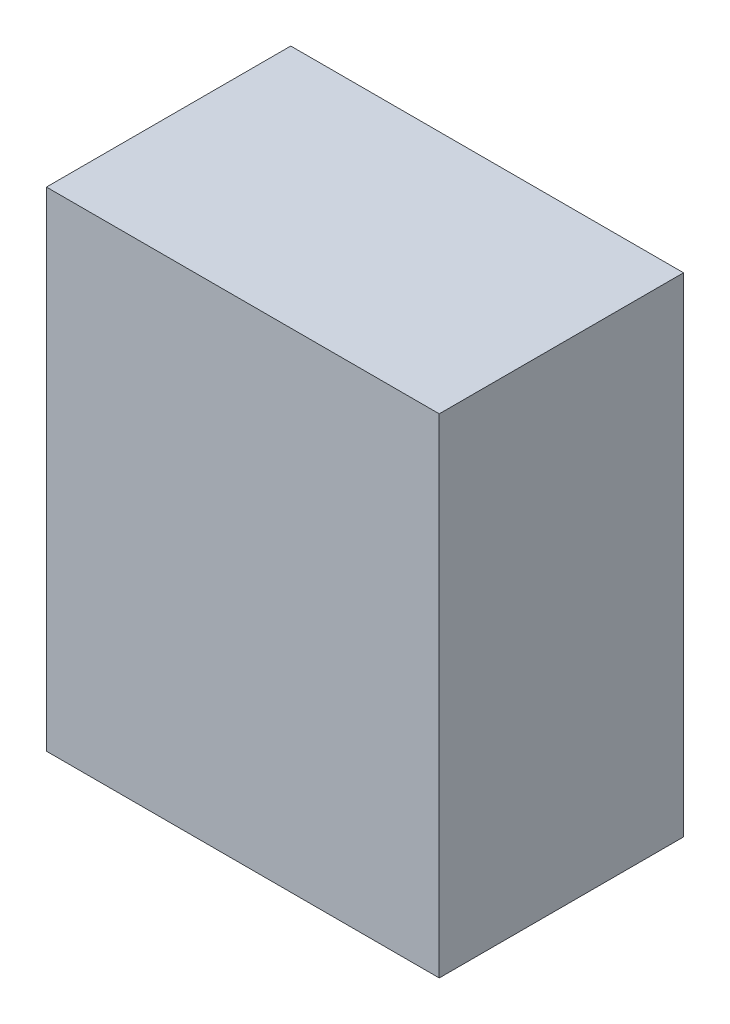
ISO-10303-21;
HEADER;
FILE_DESCRIPTION(('STEP AP214'),'2;1');
FILE_NAME('part.step','',(''),(''),'','','');
FILE_SCHEMA(('AUTOMOTIVE_DESIGN { 1 0 10303 214 1 1 1 1 }'));
ENDSEC;
DATA;
#1=APPLICATION_CONTEXT('core data for automotive mechanical design processes');
#2=APPLICATION_PROTOCOL_DEFINITION('international standard','automotive_design',2000,#1);
#3=PRODUCT_CONTEXT('',#1,'mechanical');
#4=PRODUCT('Part','Part','',(#3));
#5=PRODUCT_RELATED_PRODUCT_CATEGORY('part','',(#4));
#6=PRODUCT_DEFINITION_FORMATION('','',#4);
#7=PRODUCT_DEFINITION_CONTEXT('part definition',#1,'design');
#8=PRODUCT_DEFINITION('design','',#6,#7);
#9=PRODUCT_DEFINITION_SHAPE('','',#8);
#10=(LENGTH_UNIT() NAMED_UNIT(*) SI_UNIT(.MILLI.,.METRE.));
#11=(NAMED_UNIT(*) PLANE_ANGLE_UNIT() SI_UNIT($,.RADIAN.));
#12=(NAMED_UNIT(*) SI_UNIT($,.STERADIAN.) SOLID_ANGLE_UNIT());
#13=UNCERTAINTY_MEASURE_WITH_UNIT(LENGTH_MEASURE(1.E-05),#10,'distance_accuracy_value','');
#14=(GEOMETRIC_REPRESENTATION_CONTEXT(3) GLOBAL_UNCERTAINTY_ASSIGNED_CONTEXT((#13)) GLOBAL_UNIT_ASSIGNED_CONTEXT((#10,
#11,#12)) REPRESENTATION_CONTEXT('',''));
#15=CARTESIAN_POINT('',(0.,0.,0.));
#16=DIRECTION('',(0.,0.,1.));
#17=DIRECTION('',(1.,0.,0.));
#18=AXIS2_PLACEMENT_3D('',#15,#16,#17);
#19=CARTESIAN_POINT('',(2.05000098,2.54999998,2.55));
#20=DIRECTION('',(0.,0.,1.));
#21=DIRECTION('',(1.,0.,0.));
#22=AXIS2_PLACEMENT_3D('',#19,#20,#21);
#23=PLANE('',#22);
#24=DIRECTION('',(1.,0.,0.));
#25=VECTOR('',#24,1.);
#26=CARTESIAN_POINT('',(2.05000098,-2.54999998,2.55));
#27=LINE('',#26,#25);
#28=CARTESIAN_POINT('',(2.05000098,-2.54999998,2.55));
#29=VERTEX_POINT('',#28);
#30=CARTESIAN_POINT('',(-2.04999844,-2.54999998,2.55));
#31=VERTEX_POINT('',#30);
#32=EDGE_CURVE('E53',#29,#31,#27,.F.);
#33=ORIENTED_EDGE('',*,*,#32,.F.);
#34=DIRECTION('',(0.,1.,0.));
#35=VECTOR('',#34,1.);
#36=CARTESIAN_POINT('',(2.05000098,2.54999998,2.55));
#37=LINE('',#36,#35);
#38=CARTESIAN_POINT('',(2.05000098,2.54999998,2.55));
#39=VERTEX_POINT('',#38);
#40=EDGE_CURVE('E68',#39,#29,#37,.F.);
#41=ORIENTED_EDGE('',*,*,#40,.F.);
#42=DIRECTION('',(1.,0.,0.));
#43=VECTOR('',#42,1.);
#44=CARTESIAN_POINT('',(-2.04999844,2.54999998,2.55));
#45=LINE('',#44,#43);
#46=CARTESIAN_POINT('',(-2.04999844,2.54999998,2.55));
#47=VERTEX_POINT('',#46);
#48=EDGE_CURVE('E20',#47,#39,#45,.T.);
#49=ORIENTED_EDGE('',*,*,#48,.F.);
#50=DIRECTION('',(0.,1.,0.));
#51=VECTOR('',#50,1.);
#52=CARTESIAN_POINT('',(-2.04999844,-2.54999998,2.55));
#53=LINE('',#52,#51);
#54=EDGE_CURVE('E58',#31,#47,#53,.T.);
#55=ORIENTED_EDGE('',*,*,#54,.F.);
#56=EDGE_LOOP('',(#33,#41,#49,#55));
#57=FACE_BOUND('',#56,.T.);
#58=ADVANCED_FACE('F17',(#57),#23,.T.);
#59=CARTESIAN_POINT('',(-2.04999844,2.54999998,0.));
#60=DIRECTION('',(0.,1.,0.));
#61=DIRECTION('',(0.,0.,1.));
#62=AXIS2_PLACEMENT_3D('',#59,#60,#61);
#63=PLANE('',#62);
#64=DIRECTION('',(0.,0.,-1.));
#65=VECTOR('',#64,1.);
#66=CARTESIAN_POINT('',(2.05000098,2.54999998,0.));
#67=LINE('',#66,#65);
#68=CARTESIAN_POINT('',(2.05000098,2.54999998,0.));
#69=VERTEX_POINT('',#68);
#70=EDGE_CURVE('E79',#69,#39,#67,.F.);
#71=ORIENTED_EDGE('',*,*,#70,.F.);
#72=DIRECTION('',(1.,0.,0.));
#73=VECTOR('',#72,1.);
#74=CARTESIAN_POINT('',(2.05000098,2.54999998,0.));
#75=LINE('',#74,#73);
#76=CARTESIAN_POINT('',(-2.04999844,2.54999998,0.));
#77=VERTEX_POINT('',#76);
#78=EDGE_CURVE('E74',#69,#77,#75,.F.);
#79=ORIENTED_EDGE('',*,*,#78,.T.);
#80=DIRECTION('',(0.,0.,1.));
#81=VECTOR('',#80,1.);
#82=CARTESIAN_POINT('',(-2.04999844,2.54999998,0.));
#83=LINE('',#82,#81);
#84=EDGE_CURVE('E63',#47,#77,#83,.F.);
#85=ORIENTED_EDGE('',*,*,#84,.F.);
#86=ORIENTED_EDGE('',*,*,#48,.T.);
#87=EDGE_LOOP('',(#71,#79,#85,#86));
#88=FACE_BOUND('',#87,.T.);
#89=ADVANCED_FACE('F73',(#88),#63,.T.);
#90=CARTESIAN_POINT('',(-2.04999844,-2.54999998,0.));
#91=DIRECTION('',(-1.,0.,0.));
#92=DIRECTION('',(0.,0.,1.));
#93=AXIS2_PLACEMENT_3D('',#90,#91,#92);
#94=PLANE('',#93);
#95=ORIENTED_EDGE('',*,*,#84,.T.);
#96=DIRECTION('',(0.,1.,0.));
#97=VECTOR('',#96,1.);
#98=CARTESIAN_POINT('',(-2.04999844,2.54999998,0.));
#99=LINE('',#98,#97);
#100=CARTESIAN_POINT('',(-2.04999844,-2.54999998,0.));
#101=VERTEX_POINT('',#100);
#102=EDGE_CURVE('E84',#77,#101,#99,.F.);
#103=ORIENTED_EDGE('',*,*,#102,.T.);
#104=DIRECTION('',(0.,0.,-1.));
#105=VECTOR('',#104,1.);
#106=CARTESIAN_POINT('',(-2.04999844,-2.54999998,0.));
#107=LINE('',#106,#105);
#108=EDGE_CURVE('E65',#31,#101,#107,.T.);
#109=ORIENTED_EDGE('',*,*,#108,.F.);
#110=ORIENTED_EDGE('',*,*,#54,.T.);
#111=EDGE_LOOP('',(#95,#103,#109,#110));
#112=FACE_BOUND('',#111,.T.);
#113=ADVANCED_FACE('F60',(#112),#94,.T.);
#114=CARTESIAN_POINT('',(2.05000098,-2.54999998,0.));
#115=DIRECTION('',(0.,-1.,0.));
#116=DIRECTION('',(0.,0.,-1.));
#117=AXIS2_PLACEMENT_3D('',#114,#115,#116);
#118=PLANE('',#117);
#119=ORIENTED_EDGE('',*,*,#108,.T.);
#120=DIRECTION('',(1.,0.,0.));
#121=VECTOR('',#120,1.);
#122=CARTESIAN_POINT('',(2.05000098,-2.54999998,0.));
#123=LINE('',#122,#121);
#124=CARTESIAN_POINT('',(2.05000098,-2.54999998,0.));
#125=VERTEX_POINT('',#124);
#126=EDGE_CURVE('E26',#101,#125,#123,.T.);
#127=ORIENTED_EDGE('',*,*,#126,.T.);
#128=DIRECTION('',(0.,0.,-1.));
#129=VECTOR('',#128,1.);
#130=CARTESIAN_POINT('',(2.05000098,-2.54999998,0.));
#131=LINE('',#130,#129);
#132=EDGE_CURVE('E34',#29,#125,#131,.T.);
#133=ORIENTED_EDGE('',*,*,#132,.F.);
#134=ORIENTED_EDGE('',*,*,#32,.T.);
#135=EDGE_LOOP('',(#119,#127,#133,#134));
#136=FACE_BOUND('',#135,.T.);
#137=ADVANCED_FACE('F88',(#136),#118,.T.);
#138=CARTESIAN_POINT('',(2.05000098,2.54999998,0.));
#139=DIRECTION('',(1.,0.,0.));
#140=DIRECTION('',(0.,0.,-1.));
#141=AXIS2_PLACEMENT_3D('',#138,#139,#140);
#142=PLANE('',#141);
#143=ORIENTED_EDGE('',*,*,#132,.T.);
#144=DIRECTION('',(0.,1.,0.));
#145=VECTOR('',#144,1.);
#146=CARTESIAN_POINT('',(2.05000098,2.54999998,0.));
#147=LINE('',#146,#145);
#148=EDGE_CURVE('E11',#125,#69,#147,.T.);
#149=ORIENTED_EDGE('',*,*,#148,.T.);
#150=ORIENTED_EDGE('',*,*,#70,.T.);
#151=ORIENTED_EDGE('',*,*,#40,.T.);
#152=EDGE_LOOP('',(#143,#149,#150,#151));
#153=FACE_BOUND('',#152,.T.);
#154=ADVANCED_FACE('F91',(#153),#142,.T.);
#155=CARTESIAN_POINT('',(2.05000098,2.54999998,0.));
#156=DIRECTION('',(0.,0.,1.));
#157=DIRECTION('',(1.,0.,0.));
#158=AXIS2_PLACEMENT_3D('',#155,#156,#157);
#159=PLANE('',#158);
#160=ORIENTED_EDGE('',*,*,#126,.F.);
#161=ORIENTED_EDGE('',*,*,#102,.F.);
#162=ORIENTED_EDGE('',*,*,#78,.F.);
#163=ORIENTED_EDGE('',*,*,#148,.F.);
#164=EDGE_LOOP('',(#160,#161,#162,#163));
#165=FACE_BOUND('',#164,.T.);
#166=ADVANCED_FACE('F90',(#165),#159,.F.);
#167=CLOSED_SHELL('',(#58,#89,#113,#137,#154,#166));
#168=MANIFOLD_SOLID_BREP('B1',#167);
#169=ADVANCED_BREP_SHAPE_REPRESENTATION('',(#18,#168),#14);
#170=SHAPE_DEFINITION_REPRESENTATION(#9,#169);
ENDSEC;
END-ISO-10303-21;
